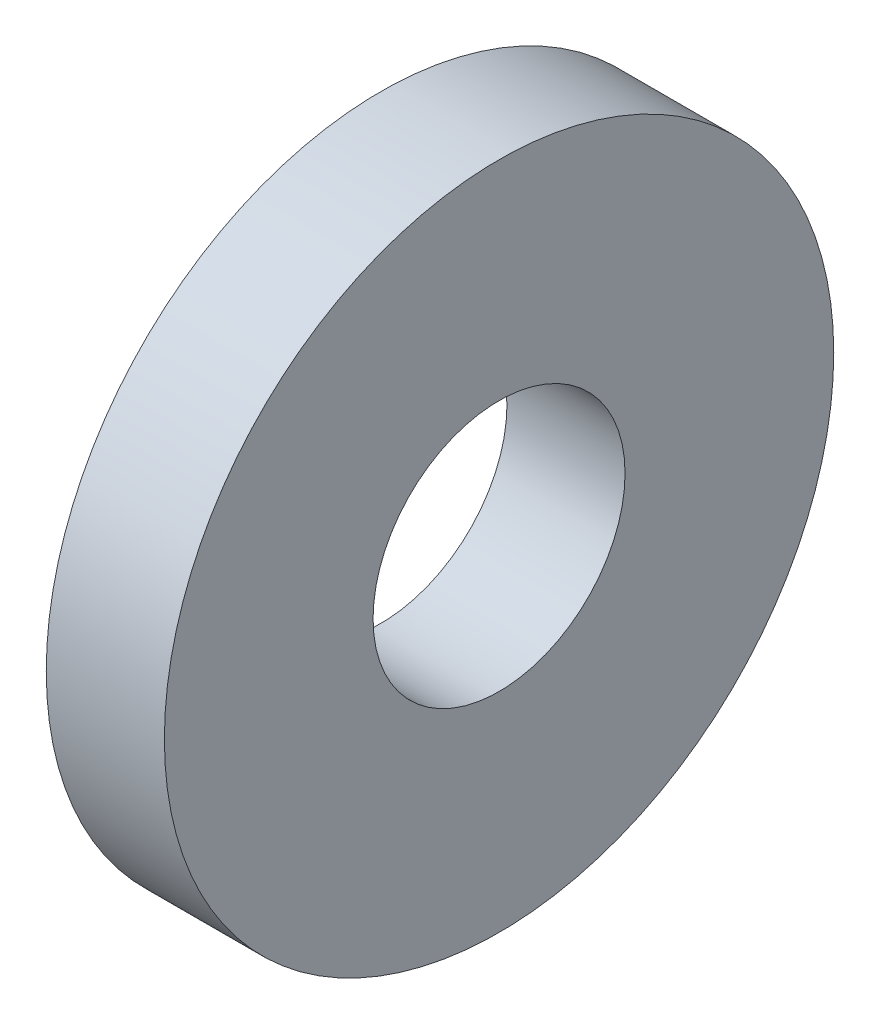
ISO-10303-21;
HEADER;
FILE_DESCRIPTION(('STEP AP214'),'2;1');
FILE_NAME('part.step','',(''),(''),'','','');
FILE_SCHEMA(('AUTOMOTIVE_DESIGN { 1 0 10303 214 1 1 1 1 }'));
ENDSEC;
DATA;
#1=APPLICATION_CONTEXT('core data for automotive mechanical design processes');
#2=APPLICATION_PROTOCOL_DEFINITION('international standard','automotive_design',2000,#1);
#3=PRODUCT_CONTEXT('',#1,'mechanical');
#4=PRODUCT('Part','Part','',(#3));
#5=PRODUCT_RELATED_PRODUCT_CATEGORY('part','',(#4));
#6=PRODUCT_DEFINITION_FORMATION('','',#4);
#7=PRODUCT_DEFINITION_CONTEXT('part definition',#1,'design');
#8=PRODUCT_DEFINITION('design','',#6,#7);
#9=PRODUCT_DEFINITION_SHAPE('','',#8);
#10=(LENGTH_UNIT() NAMED_UNIT(*) SI_UNIT(.MILLI.,.METRE.));
#11=(NAMED_UNIT(*) PLANE_ANGLE_UNIT() SI_UNIT($,.RADIAN.));
#12=(NAMED_UNIT(*) SI_UNIT($,.STERADIAN.) SOLID_ANGLE_UNIT());
#13=UNCERTAINTY_MEASURE_WITH_UNIT(LENGTH_MEASURE(1.E-05),#10,'distance_accuracy_value','');
#14=(GEOMETRIC_REPRESENTATION_CONTEXT(3) GLOBAL_UNCERTAINTY_ASSIGNED_CONTEXT((#13)) GLOBAL_UNIT_ASSIGNED_CONTEXT((#10,
#11,#12)) REPRESENTATION_CONTEXT('',''));
#15=CARTESIAN_POINT('',(0.,0.,0.));
#16=DIRECTION('',(0.,0.,1.));
#17=DIRECTION('',(1.,0.,0.));
#18=AXIS2_PLACEMENT_3D('',#15,#16,#17);
#19=CARTESIAN_POINT('',(3.,-0.860574948665288,-0.573716632443544));
#20=DIRECTION('',(1.,0.,0.));
#21=DIRECTION('',(0.,0.,-1.));
#22=AXIS2_PLACEMENT_3D('',#19,#20,#21);
#23=PLANE('',#22);
#24=CARTESIAN_POINT('',(3.,-0.860574948665288,-0.573716632443544));
#25=DIRECTION('',(1.,0.,0.));
#26=DIRECTION('',(0.,0.,-1.));
#27=AXIS2_PLACEMENT_3D('',#24,#25,#26);
#28=CIRCLE('',#27,8.5);
#29=CARTESIAN_POINT('',(3.,-0.860574948665288,-9.07371663244354));
#30=VERTEX_POINT('',#29);
#31=EDGE_CURVE('E10',#30,#30,#28,.T.);
#32=ORIENTED_EDGE('',*,*,#31,.T.);
#33=EDGE_LOOP('',(#32));
#34=FACE_BOUND('',#33,.T.);
#35=CARTESIAN_POINT('',(3.,-0.860574948665288,-0.573716632443544));
#36=DIRECTION('',(1.,0.,0.));
#37=DIRECTION('',(0.,0.,-1.));
#38=AXIS2_PLACEMENT_3D('',#35,#36,#37);
#39=CIRCLE('',#38,3.2);
#40=CARTESIAN_POINT('',(3.,-0.860574948665288,-3.77371663244354));
#41=VERTEX_POINT('',#40);
#42=EDGE_CURVE('E43',#41,#41,#39,.T.);
#43=ORIENTED_EDGE('',*,*,#42,.F.);
#44=EDGE_LOOP('',(#43));
#45=FACE_BOUND('',#44,.T.);
#46=ADVANCED_FACE('F32',(#34,#45),#23,.T.);
#47=CARTESIAN_POINT('',(0.,-0.860574948665288,-0.573716632443544));
#48=DIRECTION('',(1.,0.,0.));
#49=DIRECTION('',(0.,0.,-1.));
#50=AXIS2_PLACEMENT_3D('',#47,#48,#49);
#51=PLANE('',#50);
#52=CARTESIAN_POINT('',(0.,-0.860574948665288,-0.573716632443544));
#53=DIRECTION('',(1.,0.,0.));
#54=DIRECTION('',(0.,0.,-1.));
#55=AXIS2_PLACEMENT_3D('',#52,#53,#54);
#56=CIRCLE('',#55,8.5);
#57=CARTESIAN_POINT('',(0.,-0.860574948665288,-9.07371663244354));
#58=VERTEX_POINT('',#57);
#59=EDGE_CURVE('E36',#58,#58,#56,.T.);
#60=ORIENTED_EDGE('',*,*,#59,.F.);
#61=EDGE_LOOP('',(#60));
#62=FACE_BOUND('',#61,.T.);
#63=CARTESIAN_POINT('',(0.,-0.860574948665288,-0.573716632443544));
#64=DIRECTION('',(1.,0.,0.));
#65=DIRECTION('',(0.,0.,-1.));
#66=AXIS2_PLACEMENT_3D('',#63,#64,#65);
#67=CIRCLE('',#66,3.2);
#68=CARTESIAN_POINT('',(0.,-0.860574948665288,-3.77371663244354));
#69=VERTEX_POINT('',#68);
#70=EDGE_CURVE('E45',#69,#69,#67,.T.);
#71=ORIENTED_EDGE('',*,*,#70,.T.);
#72=EDGE_LOOP('',(#71));
#73=FACE_BOUND('',#72,.T.);
#74=ADVANCED_FACE('F55',(#62,#73),#51,.F.);
#75=CARTESIAN_POINT('',(3.,-0.860574948665288,-0.573716632443544));
#76=DIRECTION('',(-1.,0.,0.));
#77=DIRECTION('',(0.,0.,1.));
#78=AXIS2_PLACEMENT_3D('',#75,#76,#77);
#79=CYLINDRICAL_SURFACE('',#78,8.5);
#80=ORIENTED_EDGE('',*,*,#31,.F.);
#81=EDGE_LOOP('',(#80));
#82=FACE_BOUND('',#81,.T.);
#83=ORIENTED_EDGE('',*,*,#59,.T.);
#84=EDGE_LOOP('',(#83));
#85=FACE_BOUND('',#84,.T.);
#86=ADVANCED_FACE('F34',(#82,#85),#79,.T.);
#87=CARTESIAN_POINT('',(3.,-0.860574948665288,-0.573716632443544));
#88=DIRECTION('',(-1.,0.,0.));
#89=DIRECTION('',(0.,0.,1.));
#90=AXIS2_PLACEMENT_3D('',#87,#88,#89);
#91=CYLINDRICAL_SURFACE('',#90,3.2);
#92=ORIENTED_EDGE('',*,*,#42,.T.);
#93=EDGE_LOOP('',(#92));
#94=FACE_BOUND('',#93,.T.);
#95=ORIENTED_EDGE('',*,*,#70,.F.);
#96=EDGE_LOOP('',(#95));
#97=FACE_BOUND('',#96,.T.);
#98=ADVANCED_FACE('F51',(#94,#97),#91,.F.);
#99=CLOSED_SHELL('',(#46,#74,#86,#98));
#100=MANIFOLD_SOLID_BREP('B2',#99);
#101=ADVANCED_BREP_SHAPE_REPRESENTATION('',(#18,#100),#14);
#102=SHAPE_DEFINITION_REPRESENTATION(#9,#101);
ENDSEC;
END-ISO-10303-21;
